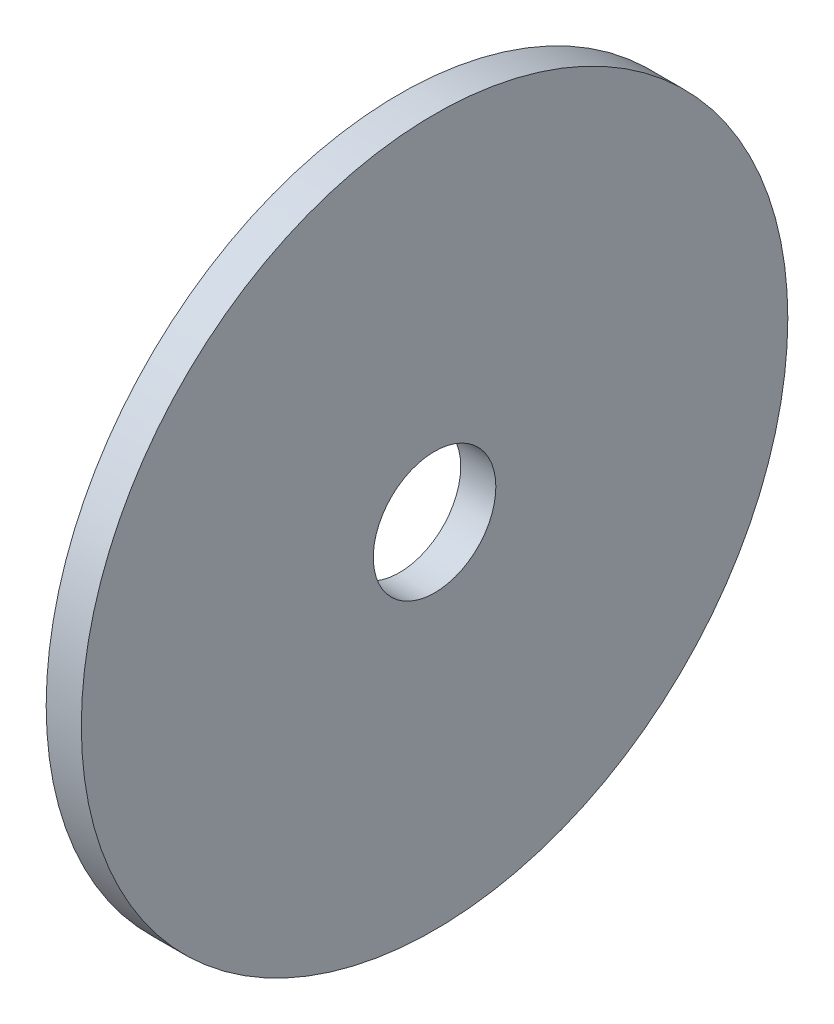
ISO-10303-21;
HEADER;
FILE_DESCRIPTION(('STEP AP214'),'2;1');
FILE_NAME('part.step','',(''),(''),'','','');
FILE_SCHEMA(('AUTOMOTIVE_DESIGN { 1 0 10303 214 1 1 1 1 }'));
ENDSEC;
DATA;
#1=APPLICATION_CONTEXT('core data for automotive mechanical design processes');
#2=APPLICATION_PROTOCOL_DEFINITION('international standard','automotive_design',2000,#1);
#3=PRODUCT_CONTEXT('',#1,'mechanical');
#4=PRODUCT('Part','Part','',(#3));
#5=PRODUCT_RELATED_PRODUCT_CATEGORY('part','',(#4));
#6=PRODUCT_DEFINITION_FORMATION('','',#4);
#7=PRODUCT_DEFINITION_CONTEXT('part definition',#1,'design');
#8=PRODUCT_DEFINITION('design','',#6,#7);
#9=PRODUCT_DEFINITION_SHAPE('','',#8);
#10=(LENGTH_UNIT() NAMED_UNIT(*) SI_UNIT(.MILLI.,.METRE.));
#11=(NAMED_UNIT(*) PLANE_ANGLE_UNIT() SI_UNIT($,.RADIAN.));
#12=(NAMED_UNIT(*) SI_UNIT($,.STERADIAN.) SOLID_ANGLE_UNIT());
#13=UNCERTAINTY_MEASURE_WITH_UNIT(LENGTH_MEASURE(1.E-05),#10,'distance_accuracy_value','');
#14=(GEOMETRIC_REPRESENTATION_CONTEXT(3) GLOBAL_UNCERTAINTY_ASSIGNED_CONTEXT((#13)) GLOBAL_UNIT_ASSIGNED_CONTEXT((#10,
#11,#12)) REPRESENTATION_CONTEXT('',''));
#15=CARTESIAN_POINT('',(0.,0.,0.));
#16=DIRECTION('',(0.,0.,1.));
#17=DIRECTION('',(1.,0.,0.));
#18=AXIS2_PLACEMENT_3D('',#15,#16,#17);
#19=CARTESIAN_POINT('',(526.034,0.,0.));
#20=DIRECTION('',(1.,0.,0.));
#21=DIRECTION('',(0.,0.,-1.));
#22=AXIS2_PLACEMENT_3D('',#19,#20,#21);
#23=PLANE('',#22);
#24=CARTESIAN_POINT('',(526.034,0.,0.));
#25=DIRECTION('',(1.,0.,0.));
#26=DIRECTION('',(0.,0.,-1.));
#27=AXIS2_PLACEMENT_3D('',#24,#25,#26);
#28=CIRCLE('',#27,9.525);
#29=CARTESIAN_POINT('',(526.034,0.,-9.525));
#30=VERTEX_POINT('',#29);
#31=EDGE_CURVE('E49',#30,#30,#28,.T.);
#32=ORIENTED_EDGE('',*,*,#31,.F.);
#33=EDGE_LOOP('',(#32));
#34=FACE_BOUND('',#33,.T.);
#35=CARTESIAN_POINT('',(526.034,0.,0.));
#36=DIRECTION('',(1.,0.,0.));
#37=DIRECTION('',(0.,0.,-1.));
#38=AXIS2_PLACEMENT_3D('',#35,#36,#37);
#39=CIRCLE('',#38,54.9054868575674);
#40=CARTESIAN_POINT('',(526.034,0.,-54.9054868575674));
#41=VERTEX_POINT('',#40);
#42=EDGE_CURVE('E60',#41,#41,#39,.T.);
#43=ORIENTED_EDGE('',*,*,#42,.T.);
#44=EDGE_LOOP('',(#43));
#45=FACE_BOUND('',#44,.T.);
#46=ADVANCED_FACE('F46',(#34,#45),#23,.T.);
#47=CARTESIAN_POINT('',(520.573,0.,0.));
#48=DIRECTION('',(1.,0.,0.));
#49=DIRECTION('',(0.,0.,-1.));
#50=AXIS2_PLACEMENT_3D('',#47,#48,#49);
#51=CYLINDRICAL_SURFACE('',#50,54.9054868575674);
#52=CARTESIAN_POINT('',(520.573,0.,0.));
#53=DIRECTION('',(1.,0.,0.));
#54=DIRECTION('',(0.,0.,-1.));
#55=AXIS2_PLACEMENT_3D('',#52,#53,#54);
#56=CIRCLE('',#55,54.9054868575674);
#57=CARTESIAN_POINT('',(520.573,0.,-54.9054868575674));
#58=VERTEX_POINT('',#57);
#59=EDGE_CURVE('E58',#58,#58,#56,.T.);
#60=ORIENTED_EDGE('',*,*,#59,.T.);
#61=EDGE_LOOP('',(#60));
#62=FACE_BOUND('',#61,.T.);
#63=ORIENTED_EDGE('',*,*,#42,.F.);
#64=EDGE_LOOP('',(#63));
#65=FACE_BOUND('',#64,.T.);
#66=ADVANCED_FACE('F68',(#62,#65),#51,.T.);
#67=CARTESIAN_POINT('',(520.573,0.,0.));
#68=DIRECTION('',(1.,0.,0.));
#69=DIRECTION('',(0.,0.,-1.));
#70=AXIS2_PLACEMENT_3D('',#67,#68,#69);
#71=CYLINDRICAL_SURFACE('',#70,9.525);
#72=CARTESIAN_POINT('',(520.573,0.,0.));
#73=DIRECTION('',(1.,0.,0.));
#74=DIRECTION('',(0.,0.,-1.));
#75=AXIS2_PLACEMENT_3D('',#72,#73,#74);
#76=CIRCLE('',#75,9.525);
#77=CARTESIAN_POINT('',(520.573,0.,-9.525));
#78=VERTEX_POINT('',#77);
#79=EDGE_CURVE('E11',#78,#78,#76,.T.);
#80=ORIENTED_EDGE('',*,*,#79,.F.);
#81=EDGE_LOOP('',(#80));
#82=FACE_BOUND('',#81,.T.);
#83=ORIENTED_EDGE('',*,*,#31,.T.);
#84=EDGE_LOOP('',(#83));
#85=FACE_BOUND('',#84,.T.);
#86=ADVANCED_FACE('F73',(#82,#85),#71,.F.);
#87=CARTESIAN_POINT('',(520.573,0.,0.));
#88=DIRECTION('',(1.,0.,0.));
#89=DIRECTION('',(0.,0.,-1.));
#90=AXIS2_PLACEMENT_3D('',#87,#88,#89);
#91=PLANE('',#90);
#92=ORIENTED_EDGE('',*,*,#79,.T.);
#93=EDGE_LOOP('',(#92));
#94=FACE_BOUND('',#93,.T.);
#95=ORIENTED_EDGE('',*,*,#59,.F.);
#96=EDGE_LOOP('',(#95));
#97=FACE_BOUND('',#96,.T.);
#98=ADVANCED_FACE('F71',(#94,#97),#91,.F.);
#99=CLOSED_SHELL('',(#46,#66,#86,#98));
#100=MANIFOLD_SOLID_BREP('B2',#99);
#101=ADVANCED_BREP_SHAPE_REPRESENTATION('',(#18,#100),#14);
#102=SHAPE_DEFINITION_REPRESENTATION(#9,#101);
ENDSEC;
END-ISO-10303-21;
